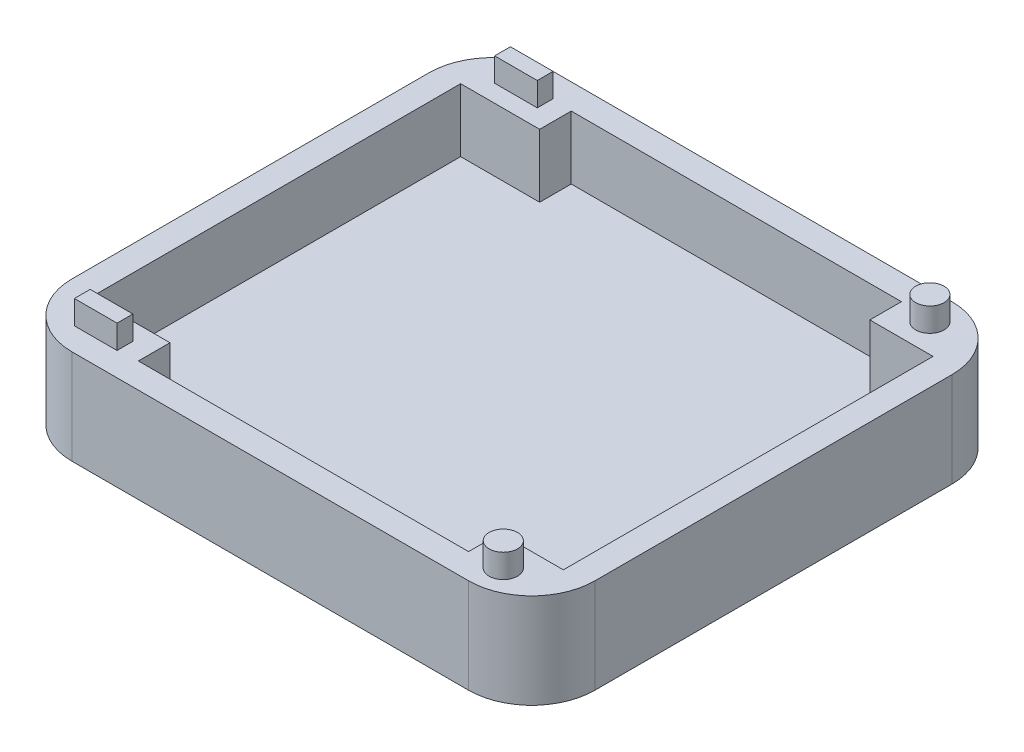
ISO-10303-21;
HEADER;
FILE_DESCRIPTION(('STEP AP214'),'2;1');
FILE_NAME('part.step','',(''),(''),'','','');
FILE_SCHEMA(('AUTOMOTIVE_DESIGN { 1 0 10303 214 1 1 1 1 }'));
ENDSEC;
DATA;
#1=APPLICATION_CONTEXT('core data for automotive mechanical design processes');
#2=APPLICATION_PROTOCOL_DEFINITION('international standard','automotive_design',2000,#1);
#3=PRODUCT_CONTEXT('',#1,'mechanical');
#4=PRODUCT('Part','Part','',(#3));
#5=PRODUCT_RELATED_PRODUCT_CATEGORY('part','',(#4));
#6=PRODUCT_DEFINITION_FORMATION('','',#4);
#7=PRODUCT_DEFINITION_CONTEXT('part definition',#1,'design');
#8=PRODUCT_DEFINITION('design','',#6,#7);
#9=PRODUCT_DEFINITION_SHAPE('','',#8);
#10=(LENGTH_UNIT() NAMED_UNIT(*) SI_UNIT(.MILLI.,.METRE.));
#11=(NAMED_UNIT(*) PLANE_ANGLE_UNIT() SI_UNIT($,.RADIAN.));
#12=(NAMED_UNIT(*) SI_UNIT($,.STERADIAN.) SOLID_ANGLE_UNIT());
#13=UNCERTAINTY_MEASURE_WITH_UNIT(LENGTH_MEASURE(1.E-05),#10,'distance_accuracy_value','');
#14=(GEOMETRIC_REPRESENTATION_CONTEXT(3) GLOBAL_UNCERTAINTY_ASSIGNED_CONTEXT((#13)) GLOBAL_UNIT_ASSIGNED_CONTEXT((#10,
#11,#12)) REPRESENTATION_CONTEXT('',''));
#15=CARTESIAN_POINT('',(0.,0.,0.));
#16=DIRECTION('',(0.,0.,1.));
#17=DIRECTION('',(1.,0.,0.));
#18=AXIS2_PLACEMENT_3D('',#15,#16,#17);
#19=CARTESIAN_POINT('',(0.,15.24,0.));
#20=DIRECTION('',(0.,1.,0.));
#21=DIRECTION('',(0.,0.,1.));
#22=AXIS2_PLACEMENT_3D('',#19,#20,#21);
#23=PLANE('',#22);
#24=CARTESIAN_POINT('',(32.893,15.24,34.29));
#25=DIRECTION('',(0.,1.,0.));
#26=DIRECTION('',(0.,0.,1.));
#27=AXIS2_PLACEMENT_3D('',#24,#25,#26);
#28=CIRCLE('',#27,2.286);
#29=CARTESIAN_POINT('',(32.893,15.24,36.576));
#30=VERTEX_POINT('',#29);
#31=EDGE_CURVE('E11',#30,#30,#28,.T.);
#32=ORIENTED_EDGE('',*,*,#31,.F.);
#33=EDGE_LOOP('',(#32));
#34=FACE_BOUND('',#33,.T.);
#35=DIRECTION('',(0.,0.,1.));
#36=VECTOR('',#35,1.);
#37=CARTESIAN_POINT('',(-28.448,15.24,32.512));
#38=LINE('',#37,#36);
#39=CARTESIAN_POINT('',(-28.448,15.24,32.512));
#40=VERTEX_POINT('',#39);
#41=CARTESIAN_POINT('',(-28.448,15.24,35.052));
#42=VERTEX_POINT('',#41);
#43=EDGE_CURVE('E228',#40,#42,#38,.T.);
#44=ORIENTED_EDGE('',*,*,#43,.T.);
#45=DIRECTION('',(-1.,0.,0.));
#46=VECTOR('',#45,1.);
#47=CARTESIAN_POINT('',(-35.306,15.24,35.052));
#48=LINE('',#47,#46);
#49=CARTESIAN_POINT('',(-35.306,15.24,35.052));
#50=VERTEX_POINT('',#49);
#51=EDGE_CURVE('E242',#42,#50,#48,.T.);
#52=ORIENTED_EDGE('',*,*,#51,.T.);
#53=DIRECTION('',(0.,0.,-1.));
#54=VECTOR('',#53,1.);
#55=CARTESIAN_POINT('',(-35.306,15.24,32.512));
#56=LINE('',#55,#54);
#57=CARTESIAN_POINT('',(-35.306,15.24,32.512));
#58=VERTEX_POINT('',#57);
#59=EDGE_CURVE('E58',#50,#58,#56,.T.);
#60=ORIENTED_EDGE('',*,*,#59,.T.);
#61=DIRECTION('',(1.,0.,0.));
#62=VECTOR('',#61,1.);
#63=CARTESIAN_POINT('',(-35.306,15.24,32.512));
#64=LINE('',#63,#62);
#65=EDGE_CURVE('E53',#58,#40,#64,.T.);
#66=ORIENTED_EDGE('',*,*,#65,.T.);
#67=EDGE_LOOP('',(#44,#52,#60,#66));
#68=FACE_BOUND('',#67,.T.);
#69=CARTESIAN_POINT('',(32.893,15.24,-34.29));
#70=DIRECTION('',(0.,1.,0.));
#71=DIRECTION('',(0.,0.,1.));
#72=AXIS2_PLACEMENT_3D('',#69,#70,#71);
#73=CIRCLE('',#72,2.286);
#74=CARTESIAN_POINT('',(32.893,15.24,-32.004));
#75=VERTEX_POINT('',#74);
#76=EDGE_CURVE('E231',#75,#75,#73,.T.);
#77=ORIENTED_EDGE('',*,*,#76,.F.);
#78=EDGE_LOOP('',(#77));
#79=FACE_BOUND('',#78,.T.);
#80=DIRECTION('',(1.,0.,0.));
#81=VECTOR('',#80,1.);
#82=CARTESIAN_POINT('',(0.,15.24,34.798));
#83=LINE('',#82,#81);
#84=CARTESIAN_POINT('',(-25.273,15.24,34.798));
#85=VERTEX_POINT('',#84);
#86=CARTESIAN_POINT('',(27.813,15.24,34.798));
#87=VERTEX_POINT('',#86);
#88=EDGE_CURVE('E297',#85,#87,#83,.T.);
#89=ORIENTED_EDGE('',*,*,#88,.F.);
#90=DIRECTION('',(0.,0.,-1.));
#91=VECTOR('',#90,1.);
#92=CARTESIAN_POINT('',(-25.273,15.24,0.));
#93=LINE('',#92,#91);
#94=CARTESIAN_POINT('',(-25.273,15.24,29.718));
#95=VERTEX_POINT('',#94);
#96=EDGE_CURVE('E300',#85,#95,#93,.T.);
#97=ORIENTED_EDGE('',*,*,#96,.T.);
#98=DIRECTION('',(1.,0.,0.));
#99=VECTOR('',#98,1.);
#100=CARTESIAN_POINT('',(0.,15.24,29.718));
#101=LINE('',#100,#99);
#102=CARTESIAN_POINT('',(-37.973,15.24,29.718));
#103=VERTEX_POINT('',#102);
#104=EDGE_CURVE('E303',#103,#95,#101,.T.);
#105=ORIENTED_EDGE('',*,*,#104,.F.);
#106=DIRECTION('',(0.,0.,1.));
#107=VECTOR('',#106,1.);
#108=CARTESIAN_POINT('',(-37.973,15.24,0.));
#109=LINE('',#108,#107);
#110=CARTESIAN_POINT('',(-37.973,15.24,-29.718));
#111=VERTEX_POINT('',#110);
#112=EDGE_CURVE('E306',#111,#103,#109,.T.);
#113=ORIENTED_EDGE('',*,*,#112,.F.);
#114=DIRECTION('',(1.,0.,0.));
#115=VECTOR('',#114,1.);
#116=CARTESIAN_POINT('',(0.,15.24,-29.718));
#117=LINE('',#116,#115);
#118=CARTESIAN_POINT('',(-25.273,15.24,-29.718));
#119=VERTEX_POINT('',#118);
#120=EDGE_CURVE('E309',#111,#119,#117,.T.);
#121=ORIENTED_EDGE('',*,*,#120,.T.);
#122=DIRECTION('',(0.,0.,1.));
#123=VECTOR('',#122,1.);
#124=CARTESIAN_POINT('',(-25.273,15.24,0.));
#125=LINE('',#124,#123);
#126=CARTESIAN_POINT('',(-25.273,15.24,-34.798));
#127=VERTEX_POINT('',#126);
#128=EDGE_CURVE('E311',#127,#119,#125,.T.);
#129=ORIENTED_EDGE('',*,*,#128,.F.);
#130=DIRECTION('',(1.,0.,0.));
#131=VECTOR('',#130,1.);
#132=CARTESIAN_POINT('',(0.,15.24,-34.798));
#133=LINE('',#132,#131);
#134=CARTESIAN_POINT('',(27.813,15.24,-34.798));
#135=VERTEX_POINT('',#134);
#136=EDGE_CURVE('E314',#127,#135,#133,.T.);
#137=ORIENTED_EDGE('',*,*,#136,.T.);
#138=DIRECTION('',(0.,0.,1.));
#139=VECTOR('',#138,1.);
#140=CARTESIAN_POINT('',(27.813,15.24,0.));
#141=LINE('',#140,#139);
#142=CARTESIAN_POINT('',(27.813,15.24,-29.718));
#143=VERTEX_POINT('',#142);
#144=EDGE_CURVE('E316',#135,#143,#141,.T.);
#145=ORIENTED_EDGE('',*,*,#144,.T.);
#146=DIRECTION('',(-1.,0.,0.));
#147=VECTOR('',#146,1.);
#148=CARTESIAN_POINT('',(0.,15.24,-29.718));
#149=LINE('',#148,#147);
#150=CARTESIAN_POINT('',(37.973,15.24,-29.718));
#151=VERTEX_POINT('',#150);
#152=EDGE_CURVE('E318',#151,#143,#149,.T.);
#153=ORIENTED_EDGE('',*,*,#152,.F.);
#154=DIRECTION('',(0.,0.,1.));
#155=VECTOR('',#154,1.);
#156=CARTESIAN_POINT('',(37.973,15.24,0.));
#157=LINE('',#156,#155);
#158=CARTESIAN_POINT('',(37.973,15.24,29.718));
#159=VERTEX_POINT('',#158);
#160=EDGE_CURVE('E321',#151,#159,#157,.T.);
#161=ORIENTED_EDGE('',*,*,#160,.T.);
#162=DIRECTION('',(-1.,0.,0.));
#163=VECTOR('',#162,1.);
#164=CARTESIAN_POINT('',(0.,15.24,29.718));
#165=LINE('',#164,#163);
#166=CARTESIAN_POINT('',(27.813,15.24,29.718));
#167=VERTEX_POINT('',#166);
#168=EDGE_CURVE('E323',#159,#167,#165,.T.);
#169=ORIENTED_EDGE('',*,*,#168,.T.);
#170=DIRECTION('',(0.,0.,-1.));
#171=VECTOR('',#170,1.);
#172=CARTESIAN_POINT('',(27.813,15.24,0.));
#173=LINE('',#172,#171);
#174=EDGE_CURVE('E325',#87,#167,#173,.T.);
#175=ORIENTED_EDGE('',*,*,#174,.F.);
#176=EDGE_LOOP('',(#89,#97,#105,#113,#121,#129,#137,#145,#153,#161,#169,#175));
#177=FACE_BOUND('',#176,.T.);
#178=DIRECTION('',(-1.,0.,0.));
#179=VECTOR('',#178,1.);
#180=CARTESIAN_POINT('',(0.,15.24,-38.862));
#181=LINE('',#180,#179);
#182=CARTESIAN_POINT('',(31.877,15.24,-38.862));
#183=VERTEX_POINT('',#182);
#184=CARTESIAN_POINT('',(-31.877,15.24,-38.862));
#185=VERTEX_POINT('',#184);
#186=EDGE_CURVE('E334',#183,#185,#181,.T.);
#187=ORIENTED_EDGE('',*,*,#186,.T.);
#188=CARTESIAN_POINT('',(-31.877,15.24,-28.702));
#189=DIRECTION('',(0.,1.,0.));
#190=DIRECTION('',(0.,0.,1.));
#191=AXIS2_PLACEMENT_3D('',#188,#189,#190);
#192=CIRCLE('',#191,10.16);
#193=CARTESIAN_POINT('',(-42.037,15.24,-28.702));
#194=VERTEX_POINT('',#193);
#195=EDGE_CURVE('E434',#185,#194,#192,.T.);
#196=ORIENTED_EDGE('',*,*,#195,.T.);
#197=DIRECTION('',(0.,0.,1.));
#198=VECTOR('',#197,1.);
#199=CARTESIAN_POINT('',(-42.037,15.24,0.));
#200=LINE('',#199,#198);
#201=CARTESIAN_POINT('',(-42.037,15.24,28.702));
#202=VERTEX_POINT('',#201);
#203=EDGE_CURVE('E337',#194,#202,#200,.T.);
#204=ORIENTED_EDGE('',*,*,#203,.T.);
#205=CARTESIAN_POINT('',(-31.877,15.24,28.702));
#206=DIRECTION('',(0.,1.,0.));
#207=DIRECTION('',(0.,0.,1.));
#208=AXIS2_PLACEMENT_3D('',#205,#206,#207);
#209=CIRCLE('',#208,10.16);
#210=CARTESIAN_POINT('',(-31.877,15.24,38.862));
#211=VERTEX_POINT('',#210);
#212=EDGE_CURVE('E428',#202,#211,#209,.T.);
#213=ORIENTED_EDGE('',*,*,#212,.T.);
#214=DIRECTION('',(1.,0.,0.));
#215=VECTOR('',#214,1.);
#216=CARTESIAN_POINT('',(0.,15.24,38.862));
#217=LINE('',#216,#215);
#218=CARTESIAN_POINT('',(31.877,15.24,38.862));
#219=VERTEX_POINT('',#218);
#220=EDGE_CURVE('E328',#211,#219,#217,.T.);
#221=ORIENTED_EDGE('',*,*,#220,.T.);
#222=CARTESIAN_POINT('',(31.877,15.24,28.702));
#223=DIRECTION('',(0.,1.,0.));
#224=DIRECTION('',(0.,0.,1.));
#225=AXIS2_PLACEMENT_3D('',#222,#223,#224);
#226=CIRCLE('',#225,10.16);
#227=CARTESIAN_POINT('',(42.037,15.24,28.702));
#228=VERTEX_POINT('',#227);
#229=EDGE_CURVE('E430',#219,#228,#226,.T.);
#230=ORIENTED_EDGE('',*,*,#229,.T.);
#231=DIRECTION('',(0.,0.,-1.));
#232=VECTOR('',#231,1.);
#233=CARTESIAN_POINT('',(42.037,15.24,0.));
#234=LINE('',#233,#232);
#235=CARTESIAN_POINT('',(42.037,15.24,-28.702));
#236=VERTEX_POINT('',#235);
#237=EDGE_CURVE('E331',#228,#236,#234,.T.);
#238=ORIENTED_EDGE('',*,*,#237,.T.);
#239=CARTESIAN_POINT('',(31.877,15.24,-28.702));
#240=DIRECTION('',(0.,1.,0.));
#241=DIRECTION('',(0.,0.,1.));
#242=AXIS2_PLACEMENT_3D('',#239,#240,#241);
#243=CIRCLE('',#242,10.16);
#244=EDGE_CURVE('E432',#236,#183,#243,.T.);
#245=ORIENTED_EDGE('',*,*,#244,.T.);
#246=EDGE_LOOP('',(#187,#196,#204,#213,#221,#230,#238,#245));
#247=FACE_BOUND('',#246,.T.);
#248=DIRECTION('',(-1.,0.,0.));
#249=VECTOR('',#248,1.);
#250=CARTESIAN_POINT('',(-35.306,15.24,-35.052));
#251=LINE('',#250,#249);
#252=CARTESIAN_POINT('',(-28.448,15.24,-35.052));
#253=VERTEX_POINT('',#252);
#254=CARTESIAN_POINT('',(-35.306,15.24,-35.052));
#255=VERTEX_POINT('',#254);
#256=EDGE_CURVE('E281',#253,#255,#251,.T.);
#257=ORIENTED_EDGE('',*,*,#256,.F.);
#258=DIRECTION('',(0.,0.,-1.));
#259=VECTOR('',#258,1.);
#260=CARTESIAN_POINT('',(-28.448,15.24,-32.512));
#261=LINE('',#260,#259);
#262=CARTESIAN_POINT('',(-28.448,15.24,-32.512));
#263=VERTEX_POINT('',#262);
#264=EDGE_CURVE('E265',#263,#253,#261,.T.);
#265=ORIENTED_EDGE('',*,*,#264,.F.);
#266=DIRECTION('',(1.,0.,0.));
#267=VECTOR('',#266,1.);
#268=CARTESIAN_POINT('',(-35.306,15.24,-32.512));
#269=LINE('',#268,#267);
#270=CARTESIAN_POINT('',(-35.306,15.24,-32.512));
#271=VERTEX_POINT('',#270);
#272=EDGE_CURVE('E272',#271,#263,#269,.T.);
#273=ORIENTED_EDGE('',*,*,#272,.F.);
#274=DIRECTION('',(0.,0.,1.));
#275=VECTOR('',#274,1.);
#276=CARTESIAN_POINT('',(-35.306,15.24,-32.512));
#277=LINE('',#276,#275);
#278=EDGE_CURVE('E283',#255,#271,#277,.T.);
#279=ORIENTED_EDGE('',*,*,#278,.F.);
#280=EDGE_LOOP('',(#257,#265,#273,#279));
#281=FACE_BOUND('',#280,.T.);
#282=ADVANCED_FACE('F38',(#34,#68,#79,#177,#247,#281),#23,.T.);
#283=CARTESIAN_POINT('',(42.037,5.08,38.862));
#284=DIRECTION('',(-1.,0.,0.));
#285=DIRECTION('',(0.,0.,1.));
#286=AXIS2_PLACEMENT_3D('',#283,#284,#285);
#287=PLANE('',#286);
#288=DIRECTION('',(0.,0.,-1.));
#289=VECTOR('',#288,1.);
#290=CARTESIAN_POINT('',(42.037,0.,38.862));
#291=LINE('',#290,#289);
#292=CARTESIAN_POINT('',(42.037,0.,28.702));
#293=VERTEX_POINT('',#292);
#294=CARTESIAN_POINT('',(42.037,0.,-28.702));
#295=VERTEX_POINT('',#294);
#296=EDGE_CURVE('E398',#293,#295,#291,.T.);
#297=ORIENTED_EDGE('',*,*,#296,.T.);
#298=DIRECTION('',(0.,-1.,0.));
#299=VECTOR('',#298,1.);
#300=CARTESIAN_POINT('',(42.037,5.08,-28.702));
#301=LINE('',#300,#299);
#302=EDGE_CURVE('E439',#295,#236,#301,.F.);
#303=ORIENTED_EDGE('',*,*,#302,.T.);
#304=ORIENTED_EDGE('',*,*,#237,.F.);
#305=DIRECTION('',(0.,-1.,0.));
#306=VECTOR('',#305,1.);
#307=CARTESIAN_POINT('',(42.037,5.08,28.702));
#308=LINE('',#307,#306);
#309=EDGE_CURVE('E436',#228,#293,#308,.T.);
#310=ORIENTED_EDGE('',*,*,#309,.T.);
#311=EDGE_LOOP('',(#297,#303,#304,#310));
#312=FACE_BOUND('',#311,.T.);
#313=ADVANCED_FACE('F459',(#312),#287,.F.);
#314=CARTESIAN_POINT('',(-42.037,5.08,-38.862));
#315=DIRECTION('',(0.,0.,1.));
#316=DIRECTION('',(1.,0.,0.));
#317=AXIS2_PLACEMENT_3D('',#314,#315,#316);
#318=PLANE('',#317);
#319=DIRECTION('',(-1.,0.,0.));
#320=VECTOR('',#319,1.);
#321=CARTESIAN_POINT('',(-42.037,0.,-38.862));
#322=LINE('',#321,#320);
#323=CARTESIAN_POINT('',(31.877,0.,-38.862));
#324=VERTEX_POINT('',#323);
#325=CARTESIAN_POINT('',(-31.877,0.,-38.862));
#326=VERTEX_POINT('',#325);
#327=EDGE_CURVE('E401',#324,#326,#322,.T.);
#328=ORIENTED_EDGE('',*,*,#327,.T.);
#329=DIRECTION('',(0.,-1.,0.));
#330=VECTOR('',#329,1.);
#331=CARTESIAN_POINT('',(-31.877,5.08,-38.862));
#332=LINE('',#331,#330);
#333=EDGE_CURVE('E426',#326,#185,#332,.F.);
#334=ORIENTED_EDGE('',*,*,#333,.T.);
#335=ORIENTED_EDGE('',*,*,#186,.F.);
#336=DIRECTION('',(0.,-1.,0.));
#337=VECTOR('',#336,1.);
#338=CARTESIAN_POINT('',(31.877,5.08,-38.862));
#339=LINE('',#338,#337);
#340=EDGE_CURVE('E423',#183,#324,#339,.T.);
#341=ORIENTED_EDGE('',*,*,#340,.T.);
#342=EDGE_LOOP('',(#328,#334,#335,#341));
#343=FACE_BOUND('',#342,.T.);
#344=ADVANCED_FACE('F471',(#343),#318,.F.);
#345=CARTESIAN_POINT('',(-42.037,5.08,38.862));
#346=DIRECTION('',(1.,0.,0.));
#347=DIRECTION('',(0.,0.,-1.));
#348=AXIS2_PLACEMENT_3D('',#345,#346,#347);
#349=PLANE('',#348);
#350=ORIENTED_EDGE('',*,*,#203,.F.);
#351=DIRECTION('',(0.,-1.,0.));
#352=VECTOR('',#351,1.);
#353=CARTESIAN_POINT('',(-42.037,5.08,-28.702));
#354=LINE('',#353,#352);
#355=CARTESIAN_POINT('',(-42.037,0.,-28.702));
#356=VERTEX_POINT('',#355);
#357=EDGE_CURVE('E412',#194,#356,#354,.T.);
#358=ORIENTED_EDGE('',*,*,#357,.T.);
#359=DIRECTION('',(0.,0.,1.));
#360=VECTOR('',#359,1.);
#361=CARTESIAN_POINT('',(-42.037,0.,38.862));
#362=LINE('',#361,#360);
#363=CARTESIAN_POINT('',(-42.037,0.,28.702));
#364=VERTEX_POINT('',#363);
#365=EDGE_CURVE('E404',#356,#364,#362,.T.);
#366=ORIENTED_EDGE('',*,*,#365,.T.);
#367=DIRECTION('',(0.,-1.,0.));
#368=VECTOR('',#367,1.);
#369=CARTESIAN_POINT('',(-42.037,5.08,28.702));
#370=LINE('',#369,#368);
#371=EDGE_CURVE('E410',#364,#202,#370,.F.);
#372=ORIENTED_EDGE('',*,*,#371,.T.);
#373=EDGE_LOOP('',(#350,#358,#366,#372));
#374=FACE_BOUND('',#373,.T.);
#375=ADVANCED_FACE('F479',(#374),#349,.F.);
#376=CARTESIAN_POINT('',(-42.037,5.08,38.862));
#377=DIRECTION('',(0.,0.,-1.));
#378=DIRECTION('',(-1.,0.,0.));
#379=AXIS2_PLACEMENT_3D('',#376,#377,#378);
#380=PLANE('',#379);
#381=DIRECTION('',(1.,0.,0.));
#382=VECTOR('',#381,1.);
#383=CARTESIAN_POINT('',(-42.037,0.,38.862));
#384=LINE('',#383,#382);
#385=CARTESIAN_POINT('',(-31.877,0.,38.862));
#386=VERTEX_POINT('',#385);
#387=CARTESIAN_POINT('',(31.877,0.,38.862));
#388=VERTEX_POINT('',#387);
#389=EDGE_CURVE('E407',#386,#388,#384,.T.);
#390=ORIENTED_EDGE('',*,*,#389,.T.);
#391=DIRECTION('',(0.,-1.,0.));
#392=VECTOR('',#391,1.);
#393=CARTESIAN_POINT('',(31.877,5.08,38.862));
#394=LINE('',#393,#392);
#395=EDGE_CURVE('E46',#388,#219,#394,.F.);
#396=ORIENTED_EDGE('',*,*,#395,.T.);
#397=ORIENTED_EDGE('',*,*,#220,.F.);
#398=DIRECTION('',(0.,-1.,0.));
#399=VECTOR('',#398,1.);
#400=CARTESIAN_POINT('',(-31.877,5.08,38.862));
#401=LINE('',#400,#399);
#402=EDGE_CURVE('E441',#211,#386,#401,.T.);
#403=ORIENTED_EDGE('',*,*,#402,.T.);
#404=EDGE_LOOP('',(#390,#396,#397,#403));
#405=FACE_BOUND('',#404,.T.);
#406=ADVANCED_FACE('F446',(#405),#380,.F.);
#407=CARTESIAN_POINT('',(0.,0.,0.));
#408=DIRECTION('',(0.,-1.,0.));
#409=DIRECTION('',(0.,0.,-1.));
#410=AXIS2_PLACEMENT_3D('',#407,#408,#409);
#411=PLANE('',#410);
#412=ORIENTED_EDGE('',*,*,#365,.F.);
#413=CARTESIAN_POINT('',(-31.877,0.,-28.702));
#414=DIRECTION('',(0.,-1.,0.));
#415=DIRECTION('',(0.,0.,-1.));
#416=AXIS2_PLACEMENT_3D('',#413,#414,#415);
#417=CIRCLE('',#416,10.16);
#418=EDGE_CURVE('E421',#356,#326,#417,.T.);
#419=ORIENTED_EDGE('',*,*,#418,.T.);
#420=ORIENTED_EDGE('',*,*,#327,.F.);
#421=CARTESIAN_POINT('',(31.877,0.,-28.702));
#422=DIRECTION('',(0.,-1.,0.));
#423=DIRECTION('',(0.,0.,-1.));
#424=AXIS2_PLACEMENT_3D('',#421,#422,#423);
#425=CIRCLE('',#424,10.16);
#426=EDGE_CURVE('E419',#324,#295,#425,.T.);
#427=ORIENTED_EDGE('',*,*,#426,.T.);
#428=ORIENTED_EDGE('',*,*,#296,.F.);
#429=CARTESIAN_POINT('',(31.877,0.,28.702));
#430=DIRECTION('',(0.,-1.,0.));
#431=DIRECTION('',(0.,0.,-1.));
#432=AXIS2_PLACEMENT_3D('',#429,#430,#431);
#433=CIRCLE('',#432,10.16);
#434=EDGE_CURVE('E417',#293,#388,#433,.T.);
#435=ORIENTED_EDGE('',*,*,#434,.T.);
#436=ORIENTED_EDGE('',*,*,#389,.F.);
#437=CARTESIAN_POINT('',(-31.877,0.,28.702));
#438=DIRECTION('',(0.,-1.,0.));
#439=DIRECTION('',(0.,0.,-1.));
#440=AXIS2_PLACEMENT_3D('',#437,#438,#439);
#441=CIRCLE('',#440,10.16);
#442=EDGE_CURVE('E415',#386,#364,#441,.T.);
#443=ORIENTED_EDGE('',*,*,#442,.T.);
#444=EDGE_LOOP('',(#412,#419,#420,#427,#428,#435,#436,#443));
#445=FACE_BOUND('',#444,.T.);
#446=ADVANCED_FACE('F463',(#445),#411,.T.);
#447=CARTESIAN_POINT('',(0.,15.24,34.798));
#448=DIRECTION('',(0.,0.,-1.));
#449=DIRECTION('',(-1.,0.,0.));
#450=AXIS2_PLACEMENT_3D('',#447,#448,#449);
#451=PLANE('',#450);
#452=DIRECTION('',(1.,0.,0.));
#453=VECTOR('',#452,1.);
#454=CARTESIAN_POINT('',(0.,5.08,34.798));
#455=LINE('',#454,#453);
#456=CARTESIAN_POINT('',(-25.273,5.08,34.798));
#457=VERTEX_POINT('',#456);
#458=CARTESIAN_POINT('',(27.813,5.08,34.798));
#459=VERTEX_POINT('',#458);
#460=EDGE_CURVE('E296',#457,#459,#455,.T.);
#461=ORIENTED_EDGE('',*,*,#460,.F.);
#462=DIRECTION('',(0.,-1.,0.));
#463=VECTOR('',#462,1.);
#464=CARTESIAN_POINT('',(-25.273,15.24,34.798));
#465=LINE('',#464,#463);
#466=EDGE_CURVE('E396',#85,#457,#465,.T.);
#467=ORIENTED_EDGE('',*,*,#466,.F.);
#468=ORIENTED_EDGE('',*,*,#88,.T.);
#469=DIRECTION('',(0.,-1.,0.));
#470=VECTOR('',#469,1.);
#471=CARTESIAN_POINT('',(27.813,15.24,34.798));
#472=LINE('',#471,#470);
#473=EDGE_CURVE('E340',#87,#459,#472,.T.);
#474=ORIENTED_EDGE('',*,*,#473,.T.);
#475=EDGE_LOOP('',(#461,#467,#468,#474));
#476=FACE_BOUND('',#475,.T.);
#477=ADVANCED_FACE('F545',(#476),#451,.T.);
#478=CARTESIAN_POINT('',(-25.273,15.24,0.));
#479=DIRECTION('',(-1.,0.,0.));
#480=DIRECTION('',(0.,0.,1.));
#481=AXIS2_PLACEMENT_3D('',#478,#479,#480);
#482=PLANE('',#481);
#483=DIRECTION('',(0.,0.,-1.));
#484=VECTOR('',#483,1.);
#485=CARTESIAN_POINT('',(-25.273,5.08,0.));
#486=LINE('',#485,#484);
#487=CARTESIAN_POINT('',(-25.273,5.08,29.718));
#488=VERTEX_POINT('',#487);
#489=EDGE_CURVE('E343',#457,#488,#486,.T.);
#490=ORIENTED_EDGE('',*,*,#489,.T.);
#491=DIRECTION('',(0.,-1.,0.));
#492=VECTOR('',#491,1.);
#493=CARTESIAN_POINT('',(-25.273,15.24,29.718));
#494=LINE('',#493,#492);
#495=EDGE_CURVE('E394',#95,#488,#494,.T.);
#496=ORIENTED_EDGE('',*,*,#495,.F.);
#497=ORIENTED_EDGE('',*,*,#96,.F.);
#498=ORIENTED_EDGE('',*,*,#466,.T.);
#499=EDGE_LOOP('',(#490,#496,#497,#498));
#500=FACE_BOUND('',#499,.T.);
#501=ADVANCED_FACE('F541',(#500),#482,.F.);
#502=CARTESIAN_POINT('',(0.,15.24,29.718));
#503=DIRECTION('',(0.,0.,-1.));
#504=DIRECTION('',(-1.,0.,0.));
#505=AXIS2_PLACEMENT_3D('',#502,#503,#504);
#506=PLANE('',#505);
#507=DIRECTION('',(1.,0.,0.));
#508=VECTOR('',#507,1.);
#509=CARTESIAN_POINT('',(0.,5.08,29.718));
#510=LINE('',#509,#508);
#511=CARTESIAN_POINT('',(-37.973,5.08,29.718));
#512=VERTEX_POINT('',#511);
#513=EDGE_CURVE('E346',#512,#488,#510,.T.);
#514=ORIENTED_EDGE('',*,*,#513,.F.);
#515=DIRECTION('',(0.,-1.,0.));
#516=VECTOR('',#515,1.);
#517=CARTESIAN_POINT('',(-37.973,15.24,29.718));
#518=LINE('',#517,#516);
#519=EDGE_CURVE('E392',#103,#512,#518,.T.);
#520=ORIENTED_EDGE('',*,*,#519,.F.);
#521=ORIENTED_EDGE('',*,*,#104,.T.);
#522=ORIENTED_EDGE('',*,*,#495,.T.);
#523=EDGE_LOOP('',(#514,#520,#521,#522));
#524=FACE_BOUND('',#523,.T.);
#525=ADVANCED_FACE('F537',(#524),#506,.T.);
#526=CARTESIAN_POINT('',(-37.973,15.24,0.));
#527=DIRECTION('',(1.,0.,0.));
#528=DIRECTION('',(0.,0.,-1.));
#529=AXIS2_PLACEMENT_3D('',#526,#527,#528);
#530=PLANE('',#529);
#531=DIRECTION('',(0.,0.,1.));
#532=VECTOR('',#531,1.);
#533=CARTESIAN_POINT('',(-37.973,5.08,0.));
#534=LINE('',#533,#532);
#535=CARTESIAN_POINT('',(-37.973,5.08,-29.718));
#536=VERTEX_POINT('',#535);
#537=EDGE_CURVE('E349',#536,#512,#534,.T.);
#538=ORIENTED_EDGE('',*,*,#537,.F.);
#539=DIRECTION('',(0.,-1.,0.));
#540=VECTOR('',#539,1.);
#541=CARTESIAN_POINT('',(-37.973,15.24,-29.718));
#542=LINE('',#541,#540);
#543=EDGE_CURVE('E390',#111,#536,#542,.T.);
#544=ORIENTED_EDGE('',*,*,#543,.F.);
#545=ORIENTED_EDGE('',*,*,#112,.T.);
#546=ORIENTED_EDGE('',*,*,#519,.T.);
#547=EDGE_LOOP('',(#538,#544,#545,#546));
#548=FACE_BOUND('',#547,.T.);
#549=ADVANCED_FACE('F533',(#548),#530,.T.);
#550=CARTESIAN_POINT('',(0.,15.24,-29.718));
#551=DIRECTION('',(0.,0.,-1.));
#552=DIRECTION('',(-1.,0.,0.));
#553=AXIS2_PLACEMENT_3D('',#550,#551,#552);
#554=PLANE('',#553);
#555=DIRECTION('',(1.,0.,0.));
#556=VECTOR('',#555,1.);
#557=CARTESIAN_POINT('',(0.,5.08,-29.718));
#558=LINE('',#557,#556);
#559=CARTESIAN_POINT('',(-25.273,5.08,-29.718));
#560=VERTEX_POINT('',#559);
#561=EDGE_CURVE('E352',#536,#560,#558,.T.);
#562=ORIENTED_EDGE('',*,*,#561,.T.);
#563=DIRECTION('',(0.,-1.,0.));
#564=VECTOR('',#563,1.);
#565=CARTESIAN_POINT('',(-25.273,15.24,-29.718));
#566=LINE('',#565,#564);
#567=EDGE_CURVE('E388',#119,#560,#566,.T.);
#568=ORIENTED_EDGE('',*,*,#567,.F.);
#569=ORIENTED_EDGE('',*,*,#120,.F.);
#570=ORIENTED_EDGE('',*,*,#543,.T.);
#571=EDGE_LOOP('',(#562,#568,#569,#570));
#572=FACE_BOUND('',#571,.T.);
#573=ADVANCED_FACE('F529',(#572),#554,.F.);
#574=CARTESIAN_POINT('',(-25.273,15.24,0.));
#575=DIRECTION('',(1.,0.,0.));
#576=DIRECTION('',(0.,0.,-1.));
#577=AXIS2_PLACEMENT_3D('',#574,#575,#576);
#578=PLANE('',#577);
#579=DIRECTION('',(0.,0.,1.));
#580=VECTOR('',#579,1.);
#581=CARTESIAN_POINT('',(-25.273,5.08,0.));
#582=LINE('',#581,#580);
#583=CARTESIAN_POINT('',(-25.273,5.08,-34.798));
#584=VERTEX_POINT('',#583);
#585=EDGE_CURVE('E355',#584,#560,#582,.T.);
#586=ORIENTED_EDGE('',*,*,#585,.F.);
#587=DIRECTION('',(0.,-1.,0.));
#588=VECTOR('',#587,1.);
#589=CARTESIAN_POINT('',(-25.273,15.24,-34.798));
#590=LINE('',#589,#588);
#591=EDGE_CURVE('E386',#127,#584,#590,.T.);
#592=ORIENTED_EDGE('',*,*,#591,.F.);
#593=ORIENTED_EDGE('',*,*,#128,.T.);
#594=ORIENTED_EDGE('',*,*,#567,.T.);
#595=EDGE_LOOP('',(#586,#592,#593,#594));
#596=FACE_BOUND('',#595,.T.);
#597=ADVANCED_FACE('F525',(#596),#578,.T.);
#598=CARTESIAN_POINT('',(0.,15.24,-34.798));
#599=DIRECTION('',(0.,0.,-1.));
#600=DIRECTION('',(-1.,0.,0.));
#601=AXIS2_PLACEMENT_3D('',#598,#599,#600);
#602=PLANE('',#601);
#603=DIRECTION('',(1.,0.,0.));
#604=VECTOR('',#603,1.);
#605=CARTESIAN_POINT('',(0.,5.08,-34.798));
#606=LINE('',#605,#604);
#607=CARTESIAN_POINT('',(27.813,5.08,-34.798));
#608=VERTEX_POINT('',#607);
#609=EDGE_CURVE('E358',#584,#608,#606,.T.);
#610=ORIENTED_EDGE('',*,*,#609,.T.);
#611=DIRECTION('',(0.,-1.,0.));
#612=VECTOR('',#611,1.);
#613=CARTESIAN_POINT('',(27.813,15.24,-34.798));
#614=LINE('',#613,#612);
#615=EDGE_CURVE('E383',#135,#608,#614,.T.);
#616=ORIENTED_EDGE('',*,*,#615,.F.);
#617=ORIENTED_EDGE('',*,*,#136,.F.);
#618=ORIENTED_EDGE('',*,*,#591,.T.);
#619=EDGE_LOOP('',(#610,#616,#617,#618));
#620=FACE_BOUND('',#619,.T.);
#621=ADVANCED_FACE('F521',(#620),#602,.F.);
#622=CARTESIAN_POINT('',(27.813,15.24,0.));
#623=DIRECTION('',(1.,0.,0.));
#624=DIRECTION('',(0.,0.,-1.));
#625=AXIS2_PLACEMENT_3D('',#622,#623,#624);
#626=PLANE('',#625);
#627=DIRECTION('',(0.,0.,1.));
#628=VECTOR('',#627,1.);
#629=CARTESIAN_POINT('',(27.813,5.08,0.));
#630=LINE('',#629,#628);
#631=CARTESIAN_POINT('',(27.813,5.08,-29.718));
#632=VERTEX_POINT('',#631);
#633=EDGE_CURVE('E360',#608,#632,#630,.T.);
#634=ORIENTED_EDGE('',*,*,#633,.T.);
#635=DIRECTION('',(0.,-1.,0.));
#636=VECTOR('',#635,1.);
#637=CARTESIAN_POINT('',(27.813,15.24,-29.718));
#638=LINE('',#637,#636);
#639=EDGE_CURVE('E381',#143,#632,#638,.T.);
#640=ORIENTED_EDGE('',*,*,#639,.F.);
#641=ORIENTED_EDGE('',*,*,#144,.F.);
#642=ORIENTED_EDGE('',*,*,#615,.T.);
#643=EDGE_LOOP('',(#634,#640,#641,#642));
#644=FACE_BOUND('',#643,.T.);
#645=ADVANCED_FACE('F517',(#644),#626,.F.);
#646=CARTESIAN_POINT('',(0.,15.24,-29.718));
#647=DIRECTION('',(0.,0.,1.));
#648=DIRECTION('',(1.,0.,0.));
#649=AXIS2_PLACEMENT_3D('',#646,#647,#648);
#650=PLANE('',#649);
#651=DIRECTION('',(-1.,0.,0.));
#652=VECTOR('',#651,1.);
#653=CARTESIAN_POINT('',(0.,5.08,-29.718));
#654=LINE('',#653,#652);
#655=CARTESIAN_POINT('',(37.973,5.08,-29.718));
#656=VERTEX_POINT('',#655);
#657=EDGE_CURVE('E363',#656,#632,#654,.T.);
#658=ORIENTED_EDGE('',*,*,#657,.F.);
#659=DIRECTION('',(0.,-1.,0.));
#660=VECTOR('',#659,1.);
#661=CARTESIAN_POINT('',(37.973,15.24,-29.718));
#662=LINE('',#661,#660);
#663=EDGE_CURVE('E379',#151,#656,#662,.T.);
#664=ORIENTED_EDGE('',*,*,#663,.F.);
#665=ORIENTED_EDGE('',*,*,#152,.T.);
#666=ORIENTED_EDGE('',*,*,#639,.T.);
#667=EDGE_LOOP('',(#658,#664,#665,#666));
#668=FACE_BOUND('',#667,.T.);
#669=ADVANCED_FACE('F513',(#668),#650,.T.);
#670=CARTESIAN_POINT('',(37.973,15.24,0.));
#671=DIRECTION('',(1.,0.,0.));
#672=DIRECTION('',(0.,0.,-1.));
#673=AXIS2_PLACEMENT_3D('',#670,#671,#672);
#674=PLANE('',#673);
#675=DIRECTION('',(0.,0.,1.));
#676=VECTOR('',#675,1.);
#677=CARTESIAN_POINT('',(37.973,5.08,0.));
#678=LINE('',#677,#676);
#679=CARTESIAN_POINT('',(37.973,5.08,29.718));
#680=VERTEX_POINT('',#679);
#681=EDGE_CURVE('E366',#656,#680,#678,.T.);
#682=ORIENTED_EDGE('',*,*,#681,.T.);
#683=DIRECTION('',(0.,-1.,0.));
#684=VECTOR('',#683,1.);
#685=CARTESIAN_POINT('',(37.973,15.24,29.718));
#686=LINE('',#685,#684);
#687=EDGE_CURVE('E376',#159,#680,#686,.T.);
#688=ORIENTED_EDGE('',*,*,#687,.F.);
#689=ORIENTED_EDGE('',*,*,#160,.F.);
#690=ORIENTED_EDGE('',*,*,#663,.T.);
#691=EDGE_LOOP('',(#682,#688,#689,#690));
#692=FACE_BOUND('',#691,.T.);
#693=ADVANCED_FACE('F509',(#692),#674,.F.);
#694=CARTESIAN_POINT('',(0.,15.24,29.718));
#695=DIRECTION('',(0.,0.,1.));
#696=DIRECTION('',(1.,0.,0.));
#697=AXIS2_PLACEMENT_3D('',#694,#695,#696);
#698=PLANE('',#697);
#699=DIRECTION('',(-1.,0.,0.));
#700=VECTOR('',#699,1.);
#701=CARTESIAN_POINT('',(0.,5.08,29.718));
#702=LINE('',#701,#700);
#703=CARTESIAN_POINT('',(27.813,5.08,29.718));
#704=VERTEX_POINT('',#703);
#705=EDGE_CURVE('E368',#680,#704,#702,.T.);
#706=ORIENTED_EDGE('',*,*,#705,.T.);
#707=DIRECTION('',(0.,-1.,0.));
#708=VECTOR('',#707,1.);
#709=CARTESIAN_POINT('',(27.813,15.24,29.718));
#710=LINE('',#709,#708);
#711=EDGE_CURVE('E373',#167,#704,#710,.T.);
#712=ORIENTED_EDGE('',*,*,#711,.F.);
#713=ORIENTED_EDGE('',*,*,#168,.F.);
#714=ORIENTED_EDGE('',*,*,#687,.T.);
#715=EDGE_LOOP('',(#706,#712,#713,#714));
#716=FACE_BOUND('',#715,.T.);
#717=ADVANCED_FACE('F505',(#716),#698,.F.);
#718=CARTESIAN_POINT('',(27.813,15.24,0.));
#719=DIRECTION('',(-1.,0.,0.));
#720=DIRECTION('',(0.,0.,1.));
#721=AXIS2_PLACEMENT_3D('',#718,#719,#720);
#722=PLANE('',#721);
#723=DIRECTION('',(0.,0.,-1.));
#724=VECTOR('',#723,1.);
#725=CARTESIAN_POINT('',(27.813,5.08,0.));
#726=LINE('',#725,#724);
#727=EDGE_CURVE('E301',#459,#704,#726,.T.);
#728=ORIENTED_EDGE('',*,*,#727,.F.);
#729=ORIENTED_EDGE('',*,*,#473,.F.);
#730=ORIENTED_EDGE('',*,*,#174,.T.);
#731=ORIENTED_EDGE('',*,*,#711,.T.);
#732=EDGE_LOOP('',(#728,#729,#730,#731));
#733=FACE_BOUND('',#732,.T.);
#734=ADVANCED_FACE('F501',(#733),#722,.T.);
#735=CARTESIAN_POINT('',(0.,5.08,0.));
#736=DIRECTION('',(0.,-1.,0.));
#737=DIRECTION('',(0.,0.,-1.));
#738=AXIS2_PLACEMENT_3D('',#735,#736,#737);
#739=PLANE('',#738);
#740=ORIENTED_EDGE('',*,*,#489,.F.);
#741=ORIENTED_EDGE('',*,*,#460,.T.);
#742=ORIENTED_EDGE('',*,*,#727,.T.);
#743=ORIENTED_EDGE('',*,*,#705,.F.);
#744=ORIENTED_EDGE('',*,*,#681,.F.);
#745=ORIENTED_EDGE('',*,*,#657,.T.);
#746=ORIENTED_EDGE('',*,*,#633,.F.);
#747=ORIENTED_EDGE('',*,*,#609,.F.);
#748=ORIENTED_EDGE('',*,*,#585,.T.);
#749=ORIENTED_EDGE('',*,*,#561,.F.);
#750=ORIENTED_EDGE('',*,*,#537,.T.);
#751=ORIENTED_EDGE('',*,*,#513,.T.);
#752=EDGE_LOOP('',(#740,#741,#742,#743,#744,#745,#746,#747,#748,#749,#750,#751));
#753=FACE_BOUND('',#752,.T.);
#754=ADVANCED_FACE('F504',(#753),#739,.F.);
#755=CARTESIAN_POINT('',(-31.877,5.08,-28.702));
#756=DIRECTION('',(0.,-1.,0.));
#757=DIRECTION('',(0.,0.,-1.));
#758=AXIS2_PLACEMENT_3D('',#755,#756,#757);
#759=CYLINDRICAL_SURFACE('',#758,10.16);
#760=ORIENTED_EDGE('',*,*,#195,.F.);
#761=ORIENTED_EDGE('',*,*,#333,.F.);
#762=ORIENTED_EDGE('',*,*,#418,.F.);
#763=ORIENTED_EDGE('',*,*,#357,.F.);
#764=EDGE_LOOP('',(#760,#761,#762,#763));
#765=FACE_BOUND('',#764,.T.);
#766=ADVANCED_FACE('F477',(#765),#759,.T.);
#767=CARTESIAN_POINT('',(31.877,5.08,-28.702));
#768=DIRECTION('',(0.,-1.,0.));
#769=DIRECTION('',(0.,0.,-1.));
#770=AXIS2_PLACEMENT_3D('',#767,#768,#769);
#771=CYLINDRICAL_SURFACE('',#770,10.16);
#772=ORIENTED_EDGE('',*,*,#244,.F.);
#773=ORIENTED_EDGE('',*,*,#302,.F.);
#774=ORIENTED_EDGE('',*,*,#426,.F.);
#775=ORIENTED_EDGE('',*,*,#340,.F.);
#776=EDGE_LOOP('',(#772,#773,#774,#775));
#777=FACE_BOUND('',#776,.T.);
#778=ADVANCED_FACE('F468',(#777),#771,.T.);
#779=CARTESIAN_POINT('',(31.877,5.08,28.702));
#780=DIRECTION('',(0.,-1.,0.));
#781=DIRECTION('',(0.,0.,-1.));
#782=AXIS2_PLACEMENT_3D('',#779,#780,#781);
#783=CYLINDRICAL_SURFACE('',#782,10.16);
#784=ORIENTED_EDGE('',*,*,#229,.F.);
#785=ORIENTED_EDGE('',*,*,#395,.F.);
#786=ORIENTED_EDGE('',*,*,#434,.F.);
#787=ORIENTED_EDGE('',*,*,#309,.F.);
#788=EDGE_LOOP('',(#784,#785,#786,#787));
#789=FACE_BOUND('',#788,.T.);
#790=ADVANCED_FACE('F456',(#789),#783,.T.);
#791=CARTESIAN_POINT('',(-31.877,5.08,28.702));
#792=DIRECTION('',(0.,-1.,0.));
#793=DIRECTION('',(0.,0.,-1.));
#794=AXIS2_PLACEMENT_3D('',#791,#792,#793);
#795=CYLINDRICAL_SURFACE('',#794,10.16);
#796=ORIENTED_EDGE('',*,*,#212,.F.);
#797=ORIENTED_EDGE('',*,*,#371,.F.);
#798=ORIENTED_EDGE('',*,*,#442,.F.);
#799=ORIENTED_EDGE('',*,*,#402,.F.);
#800=EDGE_LOOP('',(#796,#797,#798,#799));
#801=FACE_BOUND('',#800,.T.);
#802=ADVANCED_FACE('F40',(#801),#795,.T.);
#803=CARTESIAN_POINT('',(-28.448,19.05,-32.512));
#804=DIRECTION('',(-1.,0.,0.));
#805=DIRECTION('',(0.,0.,1.));
#806=AXIS2_PLACEMENT_3D('',#803,#804,#805);
#807=PLANE('',#806);
#808=ORIENTED_EDGE('',*,*,#264,.T.);
#809=DIRECTION('',(0.,-1.,0.));
#810=VECTOR('',#809,1.);
#811=CARTESIAN_POINT('',(-28.448,19.05,-35.052));
#812=LINE('',#811,#810);
#813=CARTESIAN_POINT('',(-28.448,19.05,-35.052));
#814=VERTEX_POINT('',#813);
#815=EDGE_CURVE('E294',#814,#253,#812,.T.);
#816=ORIENTED_EDGE('',*,*,#815,.F.);
#817=DIRECTION('',(0.,0.,-1.));
#818=VECTOR('',#817,1.);
#819=CARTESIAN_POINT('',(-28.448,19.05,-32.512));
#820=LINE('',#819,#818);
#821=CARTESIAN_POINT('',(-28.448,19.05,-32.512));
#822=VERTEX_POINT('',#821);
#823=EDGE_CURVE('E268',#822,#814,#820,.T.);
#824=ORIENTED_EDGE('',*,*,#823,.F.);
#825=DIRECTION('',(0.,-1.,0.));
#826=VECTOR('',#825,1.);
#827=CARTESIAN_POINT('',(-28.448,19.05,-32.512));
#828=LINE('',#827,#826);
#829=EDGE_CURVE('E278',#822,#263,#828,.T.);
#830=ORIENTED_EDGE('',*,*,#829,.T.);
#831=EDGE_LOOP('',(#808,#816,#824,#830));
#832=FACE_BOUND('',#831,.T.);
#833=ADVANCED_FACE('F483',(#832),#807,.F.);
#834=CARTESIAN_POINT('',(-35.306,19.05,-35.052));
#835=DIRECTION('',(0.,0.,1.));
#836=DIRECTION('',(1.,0.,0.));
#837=AXIS2_PLACEMENT_3D('',#834,#835,#836);
#838=PLANE('',#837);
#839=ORIENTED_EDGE('',*,*,#256,.T.);
#840=DIRECTION('',(0.,-1.,0.));
#841=VECTOR('',#840,1.);
#842=CARTESIAN_POINT('',(-35.306,19.05,-35.052));
#843=LINE('',#842,#841);
#844=CARTESIAN_POINT('',(-35.306,19.05,-35.052));
#845=VERTEX_POINT('',#844);
#846=EDGE_CURVE('E291',#845,#255,#843,.T.);
#847=ORIENTED_EDGE('',*,*,#846,.F.);
#848=DIRECTION('',(-1.,0.,0.));
#849=VECTOR('',#848,1.);
#850=CARTESIAN_POINT('',(-35.306,19.05,-35.052));
#851=LINE('',#850,#849);
#852=EDGE_CURVE('E271',#814,#845,#851,.T.);
#853=ORIENTED_EDGE('',*,*,#852,.F.);
#854=ORIENTED_EDGE('',*,*,#815,.T.);
#855=EDGE_LOOP('',(#839,#847,#853,#854));
#856=FACE_BOUND('',#855,.T.);
#857=ADVANCED_FACE('F488',(#856),#838,.F.);
#858=CARTESIAN_POINT('',(-35.306,19.05,-32.512));
#859=DIRECTION('',(1.,0.,0.));
#860=DIRECTION('',(0.,0.,-1.));
#861=AXIS2_PLACEMENT_3D('',#858,#859,#860);
#862=PLANE('',#861);
#863=ORIENTED_EDGE('',*,*,#278,.T.);
#864=DIRECTION('',(0.,-1.,0.));
#865=VECTOR('',#864,1.);
#866=CARTESIAN_POINT('',(-35.306,19.05,-32.512));
#867=LINE('',#866,#865);
#868=CARTESIAN_POINT('',(-35.306,19.05,-32.512));
#869=VERTEX_POINT('',#868);
#870=EDGE_CURVE('E289',#869,#271,#867,.T.);
#871=ORIENTED_EDGE('',*,*,#870,.F.);
#872=DIRECTION('',(0.,0.,1.));
#873=VECTOR('',#872,1.);
#874=CARTESIAN_POINT('',(-35.306,19.05,-32.512));
#875=LINE('',#874,#873);
#876=EDGE_CURVE('E274',#845,#869,#875,.T.);
#877=ORIENTED_EDGE('',*,*,#876,.F.);
#878=ORIENTED_EDGE('',*,*,#846,.T.);
#879=EDGE_LOOP('',(#863,#871,#877,#878));
#880=FACE_BOUND('',#879,.T.);
#881=ADVANCED_FACE('F593',(#880),#862,.F.);
#882=CARTESIAN_POINT('',(-35.306,19.05,-32.512));
#883=DIRECTION('',(0.,0.,-1.));
#884=DIRECTION('',(-1.,0.,0.));
#885=AXIS2_PLACEMENT_3D('',#882,#883,#884);
#886=PLANE('',#885);
#887=ORIENTED_EDGE('',*,*,#272,.T.);
#888=ORIENTED_EDGE('',*,*,#829,.F.);
#889=DIRECTION('',(1.,0.,0.));
#890=VECTOR('',#889,1.);
#891=CARTESIAN_POINT('',(-35.306,19.05,-32.512));
#892=LINE('',#891,#890);
#893=EDGE_CURVE('E276',#869,#822,#892,.T.);
#894=ORIENTED_EDGE('',*,*,#893,.F.);
#895=ORIENTED_EDGE('',*,*,#870,.T.);
#896=EDGE_LOOP('',(#887,#888,#894,#895));
#897=FACE_BOUND('',#896,.T.);
#898=ADVANCED_FACE('F602',(#897),#886,.F.);
#899=CARTESIAN_POINT('',(0.,19.05,0.));
#900=DIRECTION('',(0.,-1.,0.));
#901=DIRECTION('',(0.,0.,-1.));
#902=AXIS2_PLACEMENT_3D('',#899,#900,#901);
#903=PLANE('',#902);
#904=ORIENTED_EDGE('',*,*,#823,.T.);
#905=ORIENTED_EDGE('',*,*,#852,.T.);
#906=ORIENTED_EDGE('',*,*,#876,.T.);
#907=ORIENTED_EDGE('',*,*,#893,.T.);
#908=EDGE_LOOP('',(#904,#905,#906,#907));
#909=FACE_BOUND('',#908,.T.);
#910=ADVANCED_FACE('F612',(#909),#903,.F.);
#911=CARTESIAN_POINT('',(32.893,19.05,-34.29));
#912=DIRECTION('',(0.,-1.,0.));
#913=DIRECTION('',(0.,0.,-1.));
#914=AXIS2_PLACEMENT_3D('',#911,#912,#913);
#915=CYLINDRICAL_SURFACE('',#914,2.286);
#916=CARTESIAN_POINT('',(32.893,19.05,-34.29));
#917=DIRECTION('',(0.,1.,0.));
#918=DIRECTION('',(0.,0.,1.));
#919=AXIS2_PLACEMENT_3D('',#916,#917,#918);
#920=CIRCLE('',#919,2.286);
#921=CARTESIAN_POINT('',(32.893,19.05,-32.004));
#922=VERTEX_POINT('',#921);
#923=EDGE_CURVE('E262',#922,#922,#920,.T.);
#924=ORIENTED_EDGE('',*,*,#923,.F.);
#925=EDGE_LOOP('',(#924));
#926=FACE_BOUND('',#925,.T.);
#927=ORIENTED_EDGE('',*,*,#76,.T.);
#928=EDGE_LOOP('',(#927));
#929=FACE_BOUND('',#928,.T.);
#930=ADVANCED_FACE('F622',(#926,#929),#915,.T.);
#931=CARTESIAN_POINT('',(32.893,19.05,-34.29));
#932=DIRECTION('',(0.,1.,0.));
#933=DIRECTION('',(0.,0.,1.));
#934=AXIS2_PLACEMENT_3D('',#931,#932,#933);
#935=PLANE('',#934);
#936=ORIENTED_EDGE('',*,*,#923,.T.);
#937=EDGE_LOOP('',(#936));
#938=FACE_BOUND('',#937,.T.);
#939=ADVANCED_FACE('F632',(#938),#935,.T.);
#940=CARTESIAN_POINT('',(-28.448,19.05,32.512));
#941=DIRECTION('',(1.,0.,0.));
#942=DIRECTION('',(0.,0.,-1.));
#943=AXIS2_PLACEMENT_3D('',#940,#941,#942);
#944=PLANE('',#943);
#945=ORIENTED_EDGE('',*,*,#43,.F.);
#946=DIRECTION('',(0.,-1.,0.));
#947=VECTOR('',#946,1.);
#948=CARTESIAN_POINT('',(-28.448,19.05,32.512));
#949=LINE('',#948,#947);
#950=CARTESIAN_POINT('',(-28.448,19.05,32.512));
#951=VERTEX_POINT('',#950);
#952=EDGE_CURVE('E222',#951,#40,#949,.T.);
#953=ORIENTED_EDGE('',*,*,#952,.F.);
#954=DIRECTION('',(0.,0.,1.));
#955=VECTOR('',#954,1.);
#956=CARTESIAN_POINT('',(-28.448,19.05,32.512));
#957=LINE('',#956,#955);
#958=CARTESIAN_POINT('',(-28.448,19.05,35.052));
#959=VERTEX_POINT('',#958);
#960=EDGE_CURVE('E226',#951,#959,#957,.T.);
#961=ORIENTED_EDGE('',*,*,#960,.T.);
#962=DIRECTION('',(0.,-1.,0.));
#963=VECTOR('',#962,1.);
#964=CARTESIAN_POINT('',(-28.448,19.05,35.052));
#965=LINE('',#964,#963);
#966=EDGE_CURVE('E251',#959,#42,#965,.T.);
#967=ORIENTED_EDGE('',*,*,#966,.T.);
#968=EDGE_LOOP('',(#945,#953,#961,#967));
#969=FACE_BOUND('',#968,.T.);
#970=ADVANCED_FACE('F224',(#969),#944,.T.);
#971=CARTESIAN_POINT('',(-35.306,19.05,32.512));
#972=DIRECTION('',(0.,0.,-1.));
#973=DIRECTION('',(-1.,0.,0.));
#974=AXIS2_PLACEMENT_3D('',#971,#972,#973);
#975=PLANE('',#974);
#976=ORIENTED_EDGE('',*,*,#65,.F.);
#977=DIRECTION('',(0.,-1.,0.));
#978=VECTOR('',#977,1.);
#979=CARTESIAN_POINT('',(-35.306,19.05,32.512));
#980=LINE('',#979,#978);
#981=CARTESIAN_POINT('',(-35.306,19.05,32.512));
#982=VERTEX_POINT('',#981);
#983=EDGE_CURVE('E232',#982,#58,#980,.T.);
#984=ORIENTED_EDGE('',*,*,#983,.F.);
#985=DIRECTION('',(1.,0.,0.));
#986=VECTOR('',#985,1.);
#987=CARTESIAN_POINT('',(-35.306,19.05,32.512));
#988=LINE('',#987,#986);
#989=EDGE_CURVE('E238',#982,#951,#988,.T.);
#990=ORIENTED_EDGE('',*,*,#989,.T.);
#991=ORIENTED_EDGE('',*,*,#952,.T.);
#992=EDGE_LOOP('',(#976,#984,#990,#991));
#993=FACE_BOUND('',#992,.T.);
#994=ADVANCED_FACE('F244',(#993),#975,.T.);
#995=CARTESIAN_POINT('',(-35.306,19.05,32.512));
#996=DIRECTION('',(-1.,0.,0.));
#997=DIRECTION('',(0.,0.,1.));
#998=AXIS2_PLACEMENT_3D('',#995,#996,#997);
#999=PLANE('',#998);
#1000=ORIENTED_EDGE('',*,*,#59,.F.);
#1001=DIRECTION('',(0.,-1.,0.));
#1002=VECTOR('',#1001,1.);
#1003=CARTESIAN_POINT('',(-35.306,19.05,35.052));
#1004=LINE('',#1003,#1002);
#1005=CARTESIAN_POINT('',(-35.306,19.05,35.052));
#1006=VERTEX_POINT('',#1005);
#1007=EDGE_CURVE('E258',#1006,#50,#1004,.T.);
#1008=ORIENTED_EDGE('',*,*,#1007,.F.);
#1009=DIRECTION('',(0.,0.,-1.));
#1010=VECTOR('',#1009,1.);
#1011=CARTESIAN_POINT('',(-35.306,19.05,32.512));
#1012=LINE('',#1011,#1010);
#1013=EDGE_CURVE('E245',#1006,#982,#1012,.T.);
#1014=ORIENTED_EDGE('',*,*,#1013,.T.);
#1015=ORIENTED_EDGE('',*,*,#983,.T.);
#1016=EDGE_LOOP('',(#1000,#1008,#1014,#1015));
#1017=FACE_BOUND('',#1016,.T.);
#1018=ADVANCED_FACE('F663',(#1017),#999,.T.);
#1019=CARTESIAN_POINT('',(-35.306,19.05,35.052));
#1020=DIRECTION('',(0.,0.,1.));
#1021=DIRECTION('',(1.,0.,0.));
#1022=AXIS2_PLACEMENT_3D('',#1019,#1020,#1021);
#1023=PLANE('',#1022);
#1024=ORIENTED_EDGE('',*,*,#51,.F.);
#1025=ORIENTED_EDGE('',*,*,#966,.F.);
#1026=DIRECTION('',(-1.,0.,0.));
#1027=VECTOR('',#1026,1.);
#1028=CARTESIAN_POINT('',(-35.306,19.05,35.052));
#1029=LINE('',#1028,#1027);
#1030=EDGE_CURVE('E241',#959,#1006,#1029,.T.);
#1031=ORIENTED_EDGE('',*,*,#1030,.T.);
#1032=ORIENTED_EDGE('',*,*,#1007,.T.);
#1033=EDGE_LOOP('',(#1024,#1025,#1031,#1032));
#1034=FACE_BOUND('',#1033,.T.);
#1035=ADVANCED_FACE('F672',(#1034),#1023,.T.);
#1036=CARTESIAN_POINT('',(0.,19.05,0.));
#1037=DIRECTION('',(0.,-1.,0.));
#1038=DIRECTION('',(0.,0.,1.));
#1039=AXIS2_PLACEMENT_3D('',#1036,#1037,#1038);
#1040=PLANE('',#1039);
#1041=ORIENTED_EDGE('',*,*,#960,.F.);
#1042=ORIENTED_EDGE('',*,*,#989,.F.);
#1043=ORIENTED_EDGE('',*,*,#1013,.F.);
#1044=ORIENTED_EDGE('',*,*,#1030,.F.);
#1045=EDGE_LOOP('',(#1041,#1042,#1043,#1044));
#1046=FACE_BOUND('',#1045,.T.);
#1047=ADVANCED_FACE('F236',(#1046),#1040,.F.);
#1048=CARTESIAN_POINT('',(32.893,19.05,34.29));
#1049=DIRECTION('',(0.,-1.,0.));
#1050=DIRECTION('',(0.,0.,-1.));
#1051=AXIS2_PLACEMENT_3D('',#1048,#1049,#1050);
#1052=CYLINDRICAL_SURFACE('',#1051,2.286);
#1053=CARTESIAN_POINT('',(32.893,19.05,34.29));
#1054=DIRECTION('',(0.,-1.,0.));
#1055=DIRECTION('',(0.,0.,-1.));
#1056=AXIS2_PLACEMENT_3D('',#1053,#1054,#1055);
#1057=CIRCLE('',#1056,2.286);
#1058=CARTESIAN_POINT('',(32.893,19.05,32.004));
#1059=VERTEX_POINT('',#1058);
#1060=EDGE_CURVE('E253',#1059,#1059,#1057,.T.);
#1061=ORIENTED_EDGE('',*,*,#1060,.T.);
#1062=EDGE_LOOP('',(#1061));
#1063=FACE_BOUND('',#1062,.T.);
#1064=ORIENTED_EDGE('',*,*,#31,.T.);
#1065=EDGE_LOOP('',(#1064));
#1066=FACE_BOUND('',#1065,.T.);
#1067=ADVANCED_FACE('F691',(#1063,#1066),#1052,.T.);
#1068=CARTESIAN_POINT('',(32.893,19.05,34.29));
#1069=DIRECTION('',(0.,1.,0.));
#1070=DIRECTION('',(0.,0.,-1.));
#1071=AXIS2_PLACEMENT_3D('',#1068,#1069,#1070);
#1072=PLANE('',#1071);
#1073=ORIENTED_EDGE('',*,*,#1060,.F.);
#1074=EDGE_LOOP('',(#1073));
#1075=FACE_BOUND('',#1074,.T.);
#1076=ADVANCED_FACE('F700',(#1075),#1072,.T.);
#1077=CLOSED_SHELL('',(#282,#313,#344,#375,#406,#446,#477,#501,#525,#549,#573,#597,#621,#645,
#669,#693,#717,#734,#754,#766,#778,#790,#802,#833,#857,#881,#898,#910,#930,#939,#970,#994,#1018,
#1035,#1047,#1067,#1076));
#1078=MANIFOLD_SOLID_BREP('B2',#1077);
#1079=ADVANCED_BREP_SHAPE_REPRESENTATION('',(#18,#1078),#14);
#1080=SHAPE_DEFINITION_REPRESENTATION(#9,#1079);
ENDSEC;
END-ISO-10303-21;
